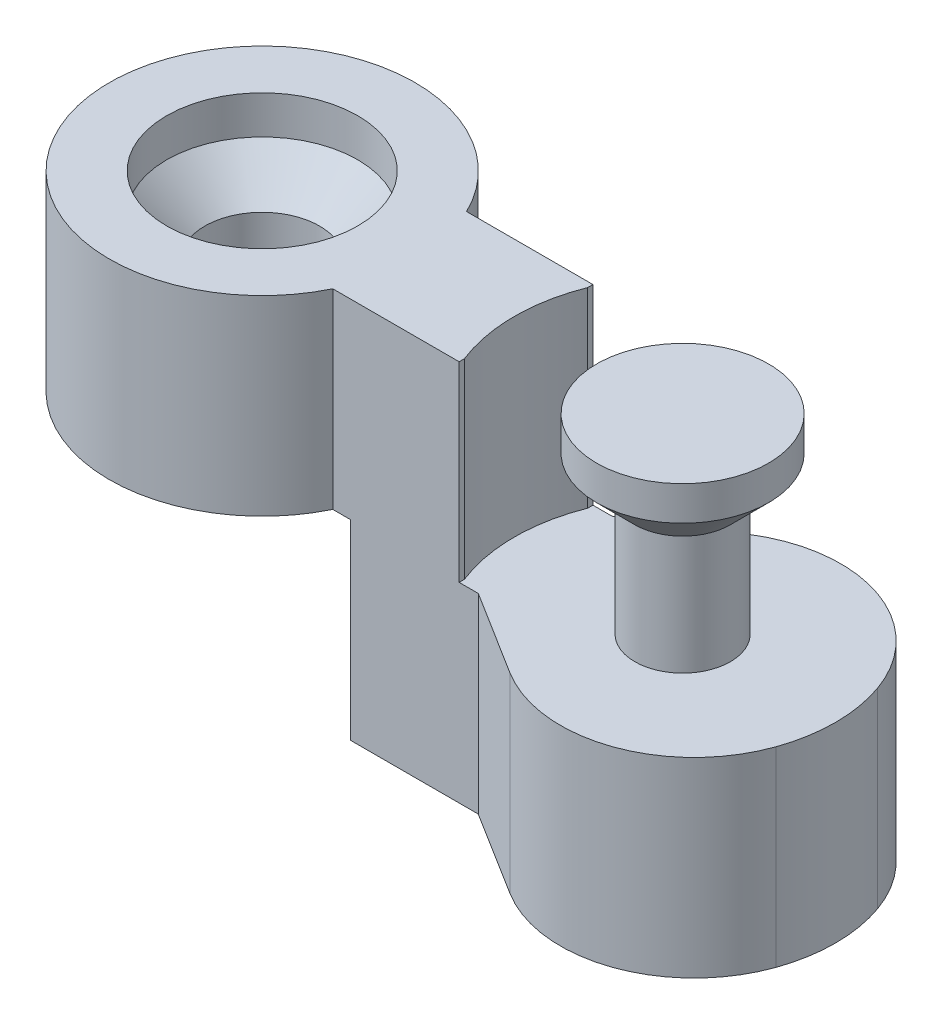
ISO-10303-21;
HEADER;
FILE_DESCRIPTION(('STEP AP214'),'2;1');
FILE_NAME('part.step','',(''),(''),'','','');
FILE_SCHEMA(('AUTOMOTIVE_DESIGN { 1 0 10303 214 1 1 1 1 }'));
ENDSEC;
DATA;
#1=APPLICATION_CONTEXT('core data for automotive mechanical design processes');
#2=APPLICATION_PROTOCOL_DEFINITION('international standard','automotive_design',2000,#1);
#3=PRODUCT_CONTEXT('',#1,'mechanical');
#4=PRODUCT('Part','Part','',(#3));
#5=PRODUCT_RELATED_PRODUCT_CATEGORY('part','',(#4));
#6=PRODUCT_DEFINITION_FORMATION('','',#4);
#7=PRODUCT_DEFINITION_CONTEXT('part definition',#1,'design');
#8=PRODUCT_DEFINITION('design','',#6,#7);
#9=PRODUCT_DEFINITION_SHAPE('','',#8);
#10=(LENGTH_UNIT() NAMED_UNIT(*) SI_UNIT(.MILLI.,.METRE.));
#11=(NAMED_UNIT(*) PLANE_ANGLE_UNIT() SI_UNIT($,.RADIAN.));
#12=(NAMED_UNIT(*) SI_UNIT($,.STERADIAN.) SOLID_ANGLE_UNIT());
#13=UNCERTAINTY_MEASURE_WITH_UNIT(LENGTH_MEASURE(1.E-05),#10,'distance_accuracy_value','');
#14=(GEOMETRIC_REPRESENTATION_CONTEXT(3) GLOBAL_UNCERTAINTY_ASSIGNED_CONTEXT((#13)) GLOBAL_UNIT_ASSIGNED_CONTEXT((#10,
#11,#12)) REPRESENTATION_CONTEXT('',''));
#15=CARTESIAN_POINT('',(0.,0.,0.));
#16=DIRECTION('',(0.,0.,1.));
#17=DIRECTION('',(1.,0.,0.));
#18=AXIS2_PLACEMENT_3D('',#15,#16,#17);
#19=CARTESIAN_POINT('',(13.8062527150309,10.5,-8.));
#20=DIRECTION('',(-1.,0.,0.));
#21=DIRECTION('',(0.,-1.,0.));
#22=AXIS2_PLACEMENT_3D('',#19,#20,#21);
#23=PLANE('',#22);
#24=DIRECTION('',(0.,0.,1.));
#25=VECTOR('',#24,1.);
#26=CARTESIAN_POINT('',(13.8062527150309,0.,-8.));
#27=LINE('',#26,#25);
#28=CARTESIAN_POINT('',(13.8062527150309,0.,3.2268548636484));
#29=VERTEX_POINT('',#28);
#30=CARTESIAN_POINT('',(13.8062527150309,0.,3.5));
#31=VERTEX_POINT('',#30);
#32=EDGE_CURVE('E221',#29,#31,#27,.T.);
#33=ORIENTED_EDGE('',*,*,#32,.F.);
#34=DIRECTION('',(0.,1.,0.));
#35=VECTOR('',#34,1.);
#36=CARTESIAN_POINT('',(13.8062527150309,0.,3.2268548636484));
#37=LINE('',#36,#35);
#38=CARTESIAN_POINT('',(13.8062527150309,10.0000000000001,3.22685486364839));
#39=VERTEX_POINT('',#38);
#40=EDGE_CURVE('E194',#29,#39,#37,.T.);
#41=ORIENTED_EDGE('',*,*,#40,.T.);
#42=DIRECTION('',(0.,0.,1.));
#43=VECTOR('',#42,1.);
#44=CARTESIAN_POINT('',(13.8062527150309,10.,0.));
#45=LINE('',#44,#43);
#46=CARTESIAN_POINT('',(13.8062527150309,10.,3.5));
#47=VERTEX_POINT('',#46);
#48=EDGE_CURVE('E234',#39,#47,#45,.T.);
#49=ORIENTED_EDGE('',*,*,#48,.T.);
#50=DIRECTION('',(0.,1.,0.));
#51=VECTOR('',#50,1.);
#52=CARTESIAN_POINT('',(13.8062527150309,10.,3.5));
#53=LINE('',#52,#51);
#54=EDGE_CURVE('E238',#31,#47,#53,.T.);
#55=ORIENTED_EDGE('',*,*,#54,.F.);
#56=EDGE_LOOP('',(#33,#41,#49,#55));
#57=FACE_BOUND('',#56,.T.);
#58=ADVANCED_FACE('F43',(#57),#23,.F.);
#59=CARTESIAN_POINT('',(0.,10.,0.));
#60=DIRECTION('',(0.,-1.,0.));
#61=DIRECTION('',(0.,0.,-1.));
#62=AXIS2_PLACEMENT_3D('',#59,#60,#61);
#63=CYLINDRICAL_SURFACE('',#62,8.);
#64=CARTESIAN_POINT('',(0.,0.,0.));
#65=DIRECTION('',(0.,1.,0.));
#66=DIRECTION('',(0.,0.,1.));
#67=AXIS2_PLACEMENT_3D('',#64,#65,#66);
#68=CIRCLE('',#67,8.);
#69=CARTESIAN_POINT('',(7.19374728496908,0.,-3.5));
#70=VERTEX_POINT('',#69);
#71=CARTESIAN_POINT('',(7.19374728496908,0.,3.5));
#72=VERTEX_POINT('',#71);
#73=EDGE_CURVE('E159',#70,#72,#68,.T.);
#74=ORIENTED_EDGE('',*,*,#73,.T.);
#75=DIRECTION('',(0.,-1.,0.));
#76=VECTOR('',#75,1.);
#77=CARTESIAN_POINT('',(7.19374728496908,10.,3.5));
#78=LINE('',#77,#76);
#79=CARTESIAN_POINT('',(7.19374728496908,10.,3.5));
#80=VERTEX_POINT('',#79);
#81=EDGE_CURVE('E263',#80,#72,#78,.T.);
#82=ORIENTED_EDGE('',*,*,#81,.F.);
#83=CARTESIAN_POINT('',(0.,10.,0.));
#84=DIRECTION('',(0.,1.,0.));
#85=DIRECTION('',(0.,0.,1.));
#86=AXIS2_PLACEMENT_3D('',#83,#84,#85);
#87=CIRCLE('',#86,8.);
#88=CARTESIAN_POINT('',(7.19374728496908,10.,-3.5));
#89=VERTEX_POINT('',#88);
#90=EDGE_CURVE('E266',#89,#80,#87,.T.);
#91=ORIENTED_EDGE('',*,*,#90,.F.);
#92=DIRECTION('',(0.,-1.,0.));
#93=VECTOR('',#92,1.);
#94=CARTESIAN_POINT('',(7.19374728496908,10.,-3.5));
#95=LINE('',#94,#93);
#96=EDGE_CURVE('E247',#89,#70,#95,.T.);
#97=ORIENTED_EDGE('',*,*,#96,.T.);
#98=EDGE_LOOP('',(#74,#82,#91,#97));
#99=FACE_BOUND('',#98,.T.);
#100=ADVANCED_FACE('F328',(#99),#63,.T.);
#101=CARTESIAN_POINT('',(0.,10.,0.));
#102=DIRECTION('',(0.,1.,0.));
#103=DIRECTION('',(0.,0.,1.));
#104=AXIS2_PLACEMENT_3D('',#101,#102,#103);
#105=PLANE('',#104);
#106=CARTESIAN_POINT('',(22.,10.0000000000001,0.));
#107=DIRECTION('',(0.,1.,0.));
#108=DIRECTION('',(0.,0.,1.));
#109=AXIS2_PLACEMENT_3D('',#106,#107,#108);
#110=CIRCLE('',#109,8.80625271503092);
#111=CARTESIAN_POINT('',(13.8062527150309,10.0000000000001,-3.22685486364839));
#112=VERTEX_POINT('',#111);
#113=EDGE_CURVE('E187',#112,#39,#110,.T.);
#114=ORIENTED_EDGE('',*,*,#113,.F.);
#115=CARTESIAN_POINT('',(13.8062527150309,10.,-3.5));
#116=VERTEX_POINT('',#115);
#117=EDGE_CURVE('E235',#116,#112,#45,.T.);
#118=ORIENTED_EDGE('',*,*,#117,.F.);
#119=DIRECTION('',(-1.,0.,0.));
#120=VECTOR('',#119,1.);
#121=CARTESIAN_POINT('',(7.19374728496908,10.,-3.5));
#122=LINE('',#121,#120);
#123=EDGE_CURVE('E245',#116,#89,#122,.T.);
#124=ORIENTED_EDGE('',*,*,#123,.T.);
#125=ORIENTED_EDGE('',*,*,#90,.T.);
#126=DIRECTION('',(1.,0.,0.));
#127=VECTOR('',#126,1.);
#128=CARTESIAN_POINT('',(7.19374728496908,10.,3.5));
#129=LINE('',#128,#127);
#130=EDGE_CURVE('E242',#80,#47,#129,.T.);
#131=ORIENTED_EDGE('',*,*,#130,.T.);
#132=ORIENTED_EDGE('',*,*,#48,.F.);
#133=EDGE_LOOP('',(#114,#118,#124,#125,#131,#132));
#134=FACE_BOUND('',#133,.T.);
#135=CARTESIAN_POINT('',(0.,10.0000000000001,0.));
#136=DIRECTION('',(0.,1.,0.));
#137=DIRECTION('',(0.,0.,1.));
#138=AXIS2_PLACEMENT_3D('',#135,#136,#137);
#139=CIRCLE('',#138,4.99999999999999);
#140=CARTESIAN_POINT('',(0.,10.0000000000001,4.99999999999999));
#141=VERTEX_POINT('',#140);
#142=EDGE_CURVE('E209',#141,#141,#139,.T.);
#143=ORIENTED_EDGE('',*,*,#142,.F.);
#144=EDGE_LOOP('',(#143));
#145=FACE_BOUND('',#144,.T.);
#146=ADVANCED_FACE('F336',(#134,#145),#105,.T.);
#147=CARTESIAN_POINT('',(0.,-10.,0.));
#148=DIRECTION('',(0.,1.,0.));
#149=DIRECTION('',(0.,0.,1.));
#150=AXIS2_PLACEMENT_3D('',#147,#148,#149);
#151=PLANE('',#150);
#152=DIRECTION('',(1.,0.,0.));
#153=VECTOR('',#152,1.);
#154=CARTESIAN_POINT('',(7.19374728496908,-10.,3.5));
#155=LINE('',#154,#153);
#156=CARTESIAN_POINT('',(8.12592127638456,-10.,3.5));
#157=VERTEX_POINT('',#156);
#158=CARTESIAN_POINT('',(14.8062527150309,-10.,3.5));
#159=VERTEX_POINT('',#158);
#160=EDGE_CURVE('E241',#157,#159,#155,.T.);
#161=ORIENTED_EDGE('',*,*,#160,.F.);
#162=CARTESIAN_POINT('',(-0.30625271503092,-10.,0.353821082885416));
#163=DIRECTION('',(0.,-1.,0.));
#164=DIRECTION('',(0.,0.,-1.));
#165=AXIS2_PLACEMENT_3D('',#162,#163,#164);
#166=CIRCLE('',#165,9.);
#167=CARTESIAN_POINT('',(8.69374728496908,-10.,0.353821082885416));
#168=VERTEX_POINT('',#167);
#169=EDGE_CURVE('E174',#168,#157,#166,.T.);
#170=ORIENTED_EDGE('',*,*,#169,.F.);
#171=DIRECTION('',(0.,0.,1.));
#172=VECTOR('',#171,1.);
#173=CARTESIAN_POINT('',(8.69374728496908,-10.,0.));
#174=LINE('',#173,#172);
#175=CARTESIAN_POINT('',(8.69374728496908,-10.,-3.5));
#176=VERTEX_POINT('',#175);
#177=EDGE_CURVE('E299',#176,#168,#174,.T.);
#178=ORIENTED_EDGE('',*,*,#177,.F.);
#179=DIRECTION('',(-1.,0.,0.));
#180=VECTOR('',#179,1.);
#181=CARTESIAN_POINT('',(7.19374728496908,-10.,-3.5));
#182=LINE('',#181,#180);
#183=CARTESIAN_POINT('',(14.8062527150309,-10.,-3.5));
#184=VERTEX_POINT('',#183);
#185=EDGE_CURVE('E180',#184,#176,#182,.T.);
#186=ORIENTED_EDGE('',*,*,#185,.F.);
#187=DIRECTION('',(-0.847791247890659,0.,0.530330085889911));
#188=VECTOR('',#187,1.);
#189=CARTESIAN_POINT('',(14.8062527150309,-10.,-3.5));
#190=LINE('',#189,#188);
#191=CARTESIAN_POINT('',(19.2305896226808,-10.,-6.26761405366909));
#192=VERTEX_POINT('',#191);
#193=EDGE_CURVE('E254',#192,#184,#190,.T.);
#194=ORIENTED_EDGE('',*,*,#193,.F.);
#195=CARTESIAN_POINT('',(22.9429002239101,-10.,-0.333075318434476));
#196=DIRECTION('',(0.,1.,0.));
#197=DIRECTION('',(0.,0.,1.));
#198=AXIS2_PLACEMENT_3D('',#195,#196,#197);
#199=CIRCLE('',#198,7.);
#200=CARTESIAN_POINT('',(29.543201791281,-10.,-2.66460254747581));
#201=VERTEX_POINT('',#200);
#202=EDGE_CURVE('E280',#192,#201,#199,.F.);
#203=ORIENTED_EDGE('',*,*,#202,.T.);
#204=CARTESIAN_POINT('',(22.,-10.,0.));
#205=DIRECTION('',(0.,1.,0.));
#206=DIRECTION('',(0.,0.,1.));
#207=AXIS2_PLACEMENT_3D('',#204,#205,#206);
#208=CIRCLE('',#207,8.);
#209=CARTESIAN_POINT('',(29.543201791281,-10.,2.66460254747582));
#210=VERTEX_POINT('',#209);
#211=EDGE_CURVE('E251',#210,#201,#208,.T.);
#212=ORIENTED_EDGE('',*,*,#211,.F.);
#213=CARTESIAN_POINT('',(22.9429002239101,-10.,0.333075318434476));
#214=DIRECTION('',(0.,1.,0.));
#215=DIRECTION('',(0.,0.,1.));
#216=AXIS2_PLACEMENT_3D('',#213,#214,#215);
#217=CIRCLE('',#216,7.);
#218=CARTESIAN_POINT('',(19.2305896226807,-10.,6.26761405366908));
#219=VERTEX_POINT('',#218);
#220=EDGE_CURVE('E282',#210,#219,#217,.F.);
#221=ORIENTED_EDGE('',*,*,#220,.T.);
#222=DIRECTION('',(0.847791247890659,0.,0.530330085889911));
#223=VECTOR('',#222,1.);
#224=CARTESIAN_POINT('',(14.8062527150309,-10.,3.5));
#225=LINE('',#224,#223);
#226=EDGE_CURVE('E249',#159,#219,#225,.T.);
#227=ORIENTED_EDGE('',*,*,#226,.F.);
#228=EDGE_LOOP('',(#161,#170,#178,#186,#194,#203,#212,#221,#227));
#229=FACE_BOUND('',#228,.T.);
#230=ADVANCED_FACE('F296',(#229),#151,.F.);
#231=CARTESIAN_POINT('',(7.19374728496908,10.,3.5));
#232=DIRECTION('',(0.,0.,-1.));
#233=DIRECTION('',(-1.,0.,0.));
#234=AXIS2_PLACEMENT_3D('',#231,#232,#233);
#235=PLANE('',#234);
#236=DIRECTION('',(-1.,0.,0.));
#237=VECTOR('',#236,1.);
#238=CARTESIAN_POINT('',(7.19374728496908,0.,3.5));
#239=LINE('',#238,#237);
#240=CARTESIAN_POINT('',(8.12592127638456,0.,3.5));
#241=VERTEX_POINT('',#240);
#242=EDGE_CURVE('E164',#241,#72,#239,.T.);
#243=ORIENTED_EDGE('',*,*,#242,.F.);
#244=DIRECTION('',(0.,-1.,0.));
#245=VECTOR('',#244,1.);
#246=CARTESIAN_POINT('',(8.12592127638456,0.,3.5));
#247=LINE('',#246,#245);
#248=EDGE_CURVE('E11',#241,#157,#247,.T.);
#249=ORIENTED_EDGE('',*,*,#248,.T.);
#250=ORIENTED_EDGE('',*,*,#160,.T.);
#251=DIRECTION('',(0.,-1.,0.));
#252=VECTOR('',#251,1.);
#253=CARTESIAN_POINT('',(14.8062527150309,10.,3.5));
#254=LINE('',#253,#252);
#255=CARTESIAN_POINT('',(14.8062527150309,0.,3.5));
#256=VERTEX_POINT('',#255);
#257=EDGE_CURVE('E260',#256,#159,#254,.T.);
#258=ORIENTED_EDGE('',*,*,#257,.F.);
#259=DIRECTION('',(-1.,0.,0.));
#260=VECTOR('',#259,1.);
#261=CARTESIAN_POINT('',(7.19374728496908,0.,3.5));
#262=LINE('',#261,#260);
#263=EDGE_CURVE('E232',#256,#31,#262,.T.);
#264=ORIENTED_EDGE('',*,*,#263,.T.);
#265=ORIENTED_EDGE('',*,*,#54,.T.);
#266=ORIENTED_EDGE('',*,*,#130,.F.);
#267=ORIENTED_EDGE('',*,*,#81,.T.);
#268=EDGE_LOOP('',(#243,#249,#250,#258,#264,#265,#266,#267));
#269=FACE_BOUND('',#268,.T.);
#270=ADVANCED_FACE('F305',(#269),#235,.F.);
#271=CARTESIAN_POINT('',(14.8062527150309,10.,3.5));
#272=DIRECTION('',(0.530330085889911,0.,-0.847791247890659));
#273=DIRECTION('',(-0.847791247890659,0.,-0.530330085889911));
#274=AXIS2_PLACEMENT_3D('',#271,#272,#273);
#275=PLANE('',#274);
#276=ORIENTED_EDGE('',*,*,#226,.T.);
#277=DIRECTION('',(0.,-1.,0.));
#278=VECTOR('',#277,1.);
#279=CARTESIAN_POINT('',(19.2305896226807,10.,6.26761405366908));
#280=LINE('',#279,#278);
#281=CARTESIAN_POINT('',(19.2305896226807,0.,6.26761405366908));
#282=VERTEX_POINT('',#281);
#283=EDGE_CURVE('E66',#219,#282,#280,.F.);
#284=ORIENTED_EDGE('',*,*,#283,.T.);
#285=DIRECTION('',(-0.847791247890659,0.,-0.530330085889911));
#286=VECTOR('',#285,1.);
#287=CARTESIAN_POINT('',(14.8062527150309,0.,3.5));
#288=LINE('',#287,#286);
#289=EDGE_CURVE('E230',#282,#256,#288,.T.);
#290=ORIENTED_EDGE('',*,*,#289,.T.);
#291=ORIENTED_EDGE('',*,*,#257,.T.);
#292=EDGE_LOOP('',(#276,#284,#290,#291));
#293=FACE_BOUND('',#292,.T.);
#294=ADVANCED_FACE('F308',(#293),#275,.F.);
#295=CARTESIAN_POINT('',(22.,10.,0.));
#296=DIRECTION('',(0.,-1.,0.));
#297=DIRECTION('',(0.,0.,-1.));
#298=AXIS2_PLACEMENT_3D('',#295,#296,#297);
#299=CYLINDRICAL_SURFACE('',#298,8.);
#300=CARTESIAN_POINT('',(22.,0.,0.));
#301=DIRECTION('',(0.,-1.,0.));
#302=DIRECTION('',(0.,0.,-1.));
#303=AXIS2_PLACEMENT_3D('',#300,#301,#302);
#304=CIRCLE('',#303,8.);
#305=CARTESIAN_POINT('',(29.543201791281,0.,-2.66460254747581));
#306=VERTEX_POINT('',#305);
#307=CARTESIAN_POINT('',(29.543201791281,0.,2.66460254747582));
#308=VERTEX_POINT('',#307);
#309=EDGE_CURVE('E227',#306,#308,#304,.T.);
#310=ORIENTED_EDGE('',*,*,#309,.T.);
#311=DIRECTION('',(0.,-1.,0.));
#312=VECTOR('',#311,1.);
#313=CARTESIAN_POINT('',(29.543201791281,10.,2.66460254747582));
#314=LINE('',#313,#312);
#315=EDGE_CURVE('E277',#308,#210,#314,.T.);
#316=ORIENTED_EDGE('',*,*,#315,.T.);
#317=ORIENTED_EDGE('',*,*,#211,.T.);
#318=DIRECTION('',(0.,-1.,0.));
#319=VECTOR('',#318,1.);
#320=CARTESIAN_POINT('',(29.543201791281,10.,-2.66460254747581));
#321=LINE('',#320,#319);
#322=EDGE_CURVE('E275',#201,#306,#321,.F.);
#323=ORIENTED_EDGE('',*,*,#322,.T.);
#324=EDGE_LOOP('',(#310,#316,#317,#323));
#325=FACE_BOUND('',#324,.T.);
#326=ADVANCED_FACE('F317',(#325),#299,.T.);
#327=CARTESIAN_POINT('',(14.8062527150309,10.,-3.5));
#328=DIRECTION('',(0.530330085889911,0.,0.847791247890659));
#329=DIRECTION('',(0.847791247890659,0.,-0.530330085889911));
#330=AXIS2_PLACEMENT_3D('',#327,#328,#329);
#331=PLANE('',#330);
#332=DIRECTION('',(0.847791247890659,0.,-0.530330085889911));
#333=VECTOR('',#332,1.);
#334=CARTESIAN_POINT('',(14.8062527150309,0.,-3.5));
#335=LINE('',#334,#333);
#336=CARTESIAN_POINT('',(14.8062527150309,0.,-3.5));
#337=VERTEX_POINT('',#336);
#338=CARTESIAN_POINT('',(19.2305896226808,0.,-6.26761405366909));
#339=VERTEX_POINT('',#338);
#340=EDGE_CURVE('E225',#337,#339,#335,.T.);
#341=ORIENTED_EDGE('',*,*,#340,.T.);
#342=DIRECTION('',(0.,-1.,0.));
#343=VECTOR('',#342,1.);
#344=CARTESIAN_POINT('',(19.2305896226808,10.,-6.26761405366909));
#345=LINE('',#344,#343);
#346=EDGE_CURVE('E51',#339,#192,#345,.T.);
#347=ORIENTED_EDGE('',*,*,#346,.T.);
#348=ORIENTED_EDGE('',*,*,#193,.T.);
#349=DIRECTION('',(0.,-1.,0.));
#350=VECTOR('',#349,1.);
#351=CARTESIAN_POINT('',(14.8062527150309,10.,-3.5));
#352=LINE('',#351,#350);
#353=EDGE_CURVE('E258',#337,#184,#352,.T.);
#354=ORIENTED_EDGE('',*,*,#353,.F.);
#355=EDGE_LOOP('',(#341,#347,#348,#354));
#356=FACE_BOUND('',#355,.T.);
#357=ADVANCED_FACE('F291',(#356),#331,.F.);
#358=CARTESIAN_POINT('',(7.19374728496908,10.,-3.5));
#359=DIRECTION('',(0.,0.,1.));
#360=DIRECTION('',(1.,0.,0.));
#361=AXIS2_PLACEMENT_3D('',#358,#359,#360);
#362=PLANE('',#361);
#363=ORIENTED_EDGE('',*,*,#185,.T.);
#364=DIRECTION('',(0.,-1.,0.));
#365=VECTOR('',#364,1.);
#366=CARTESIAN_POINT('',(8.69374728496908,0.,-3.5));
#367=LINE('',#366,#365);
#368=CARTESIAN_POINT('',(8.69374728496908,0.,-3.5));
#369=VERTEX_POINT('',#368);
#370=EDGE_CURVE('E170',#369,#176,#367,.T.);
#371=ORIENTED_EDGE('',*,*,#370,.F.);
#372=DIRECTION('',(1.,0.,0.));
#373=VECTOR('',#372,1.);
#374=CARTESIAN_POINT('',(7.19374728496908,0.,-3.5));
#375=LINE('',#374,#373);
#376=EDGE_CURVE('E153',#70,#369,#375,.T.);
#377=ORIENTED_EDGE('',*,*,#376,.F.);
#378=ORIENTED_EDGE('',*,*,#96,.F.);
#379=ORIENTED_EDGE('',*,*,#123,.F.);
#380=DIRECTION('',(0.,-1.,0.));
#381=VECTOR('',#380,1.);
#382=CARTESIAN_POINT('',(13.8062527150309,10.,-3.5));
#383=LINE('',#382,#381);
#384=CARTESIAN_POINT('',(13.8062527150309,0.,-3.5));
#385=VERTEX_POINT('',#384);
#386=EDGE_CURVE('E271',#116,#385,#383,.T.);
#387=ORIENTED_EDGE('',*,*,#386,.T.);
#388=DIRECTION('',(1.,0.,0.));
#389=VECTOR('',#388,1.);
#390=CARTESIAN_POINT('',(7.19374728496908,0.,-3.5));
#391=LINE('',#390,#389);
#392=EDGE_CURVE('E269',#385,#337,#391,.T.);
#393=ORIENTED_EDGE('',*,*,#392,.T.);
#394=ORIENTED_EDGE('',*,*,#353,.T.);
#395=EDGE_LOOP('',(#363,#371,#377,#378,#379,#387,#393,#394));
#396=FACE_BOUND('',#395,.T.);
#397=ADVANCED_FACE('F177',(#396),#362,.F.);
#398=ORIENTED_EDGE('',*,*,#117,.T.);
#399=DIRECTION('',(0.,1.,0.));
#400=VECTOR('',#399,1.);
#401=CARTESIAN_POINT('',(13.8062527150309,0.,-3.2268548636484));
#402=LINE('',#401,#400);
#403=CARTESIAN_POINT('',(13.8062527150309,0.,-3.2268548636484));
#404=VERTEX_POINT('',#403);
#405=EDGE_CURVE('E190',#112,#404,#402,.F.);
#406=ORIENTED_EDGE('',*,*,#405,.T.);
#407=EDGE_CURVE('E222',#385,#404,#27,.T.);
#408=ORIENTED_EDGE('',*,*,#407,.F.);
#409=ORIENTED_EDGE('',*,*,#386,.F.);
#410=EDGE_LOOP('',(#398,#406,#408,#409));
#411=FACE_BOUND('',#410,.T.);
#412=ADVANCED_FACE('F331',(#411),#23,.F.);
#413=CARTESIAN_POINT('',(13.8062527150309,0.,-8.));
#414=DIRECTION('',(0.,-1.,0.));
#415=DIRECTION('',(0.,0.,-1.));
#416=AXIS2_PLACEMENT_3D('',#413,#414,#415);
#417=PLANE('',#416);
#418=ORIENTED_EDGE('',*,*,#289,.F.);
#419=CARTESIAN_POINT('',(22.9429002239101,0.,0.333075318434476));
#420=DIRECTION('',(0.,-1.,0.));
#421=DIRECTION('',(0.,0.,-1.));
#422=AXIS2_PLACEMENT_3D('',#419,#420,#421);
#423=CIRCLE('',#422,7.);
#424=EDGE_CURVE('E286',#282,#308,#423,.F.);
#425=ORIENTED_EDGE('',*,*,#424,.T.);
#426=ORIENTED_EDGE('',*,*,#309,.F.);
#427=CARTESIAN_POINT('',(22.9429002239101,0.,-0.333075318434476));
#428=DIRECTION('',(0.,-1.,0.));
#429=DIRECTION('',(0.,0.,-1.));
#430=AXIS2_PLACEMENT_3D('',#427,#428,#429);
#431=CIRCLE('',#430,7.);
#432=EDGE_CURVE('E58',#306,#339,#431,.F.);
#433=ORIENTED_EDGE('',*,*,#432,.T.);
#434=ORIENTED_EDGE('',*,*,#340,.F.);
#435=ORIENTED_EDGE('',*,*,#392,.F.);
#436=ORIENTED_EDGE('',*,*,#407,.T.);
#437=CARTESIAN_POINT('',(22.,0.,0.));
#438=DIRECTION('',(0.,1.,0.));
#439=DIRECTION('',(0.,0.,1.));
#440=AXIS2_PLACEMENT_3D('',#437,#438,#439);
#441=CIRCLE('',#440,8.80625271503092);
#442=EDGE_CURVE('E188',#404,#29,#441,.T.);
#443=ORIENTED_EDGE('',*,*,#442,.T.);
#444=ORIENTED_EDGE('',*,*,#32,.T.);
#445=ORIENTED_EDGE('',*,*,#263,.F.);
#446=EDGE_LOOP('',(#418,#425,#426,#433,#434,#435,#436,#443,#444,#445));
#447=FACE_BOUND('',#446,.T.);
#448=CARTESIAN_POINT('',(22.,0.,0.));
#449=DIRECTION('',(0.,1.,0.));
#450=DIRECTION('',(0.,0.,1.));
#451=AXIS2_PLACEMENT_3D('',#448,#449,#450);
#452=CIRCLE('',#451,2.50000000000005);
#453=CARTESIAN_POINT('',(22.,0.,2.50000000000005));
#454=VERTEX_POINT('',#453);
#455=EDGE_CURVE('E206',#454,#454,#452,.T.);
#456=ORIENTED_EDGE('',*,*,#455,.F.);
#457=EDGE_LOOP('',(#456));
#458=FACE_BOUND('',#457,.T.);
#459=ADVANCED_FACE('F313',(#447,#458),#417,.F.);
#460=CARTESIAN_POINT('',(-8.5,0.,-8.));
#461=DIRECTION('',(0.,1.,0.));
#462=DIRECTION('',(0.,0.,1.));
#463=AXIS2_PLACEMENT_3D('',#460,#461,#462);
#464=PLANE('',#463);
#465=CARTESIAN_POINT('',(0.,0.,0.));
#466=DIRECTION('',(0.,1.,0.));
#467=DIRECTION('',(0.,0.,1.));
#468=AXIS2_PLACEMENT_3D('',#465,#466,#467);
#469=CIRCLE('',#468,2.99999999999999);
#470=CARTESIAN_POINT('',(0.,0.,2.99999999999999));
#471=VERTEX_POINT('',#470);
#472=EDGE_CURVE('E218',#471,#471,#469,.T.);
#473=ORIENTED_EDGE('',*,*,#472,.T.);
#474=EDGE_LOOP('',(#473));
#475=FACE_BOUND('',#474,.T.);
#476=ORIENTED_EDGE('',*,*,#73,.F.);
#477=ORIENTED_EDGE('',*,*,#376,.T.);
#478=DIRECTION('',(0.,0.,1.));
#479=VECTOR('',#478,1.);
#480=CARTESIAN_POINT('',(8.69374728496908,0.,0.));
#481=LINE('',#480,#479);
#482=CARTESIAN_POINT('',(8.69374728496908,0.,0.353821082885416));
#483=VERTEX_POINT('',#482);
#484=EDGE_CURVE('E157',#369,#483,#481,.T.);
#485=ORIENTED_EDGE('',*,*,#484,.T.);
#486=CARTESIAN_POINT('',(-0.30625271503092,0.,0.353821082885416));
#487=DIRECTION('',(0.,-1.,0.));
#488=DIRECTION('',(0.,0.,-1.));
#489=AXIS2_PLACEMENT_3D('',#486,#487,#488);
#490=CIRCLE('',#489,9.);
#491=EDGE_CURVE('E173',#483,#241,#490,.T.);
#492=ORIENTED_EDGE('',*,*,#491,.T.);
#493=ORIENTED_EDGE('',*,*,#242,.T.);
#494=EDGE_LOOP('',(#476,#477,#485,#492,#493));
#495=FACE_BOUND('',#494,.T.);
#496=ADVANCED_FACE('F155',(#475,#495),#464,.F.);
#497=CARTESIAN_POINT('',(0.,11.592954006499,0.));
#498=DIRECTION('',(0.,1.,0.));
#499=DIRECTION('',(0.,0.,1.));
#500=AXIS2_PLACEMENT_3D('',#497,#498,#499);
#501=CYLINDRICAL_SURFACE('',#500,2.99999999999999);
#502=CARTESIAN_POINT('',(0.,6.00000000000006,0.));
#503=DIRECTION('',(0.,1.,0.));
#504=DIRECTION('',(0.,0.,1.));
#505=AXIS2_PLACEMENT_3D('',#502,#503,#504);
#506=CIRCLE('',#505,2.99999999999999);
#507=CARTESIAN_POINT('',(0.,6.00000000000006,2.99999999999999));
#508=VERTEX_POINT('',#507);
#509=EDGE_CURVE('E215',#508,#508,#506,.T.);
#510=ORIENTED_EDGE('',*,*,#509,.T.);
#511=EDGE_LOOP('',(#510));
#512=FACE_BOUND('',#511,.T.);
#513=ORIENTED_EDGE('',*,*,#472,.F.);
#514=EDGE_LOOP('',(#513));
#515=FACE_BOUND('',#514,.T.);
#516=ADVANCED_FACE('F391',(#512,#515),#501,.F.);
#517=CARTESIAN_POINT('',(0.,6.00000000000006,0.));
#518=DIRECTION('',(0.,1.,0.));
#519=DIRECTION('',(0.,0.,1.));
#520=AXIS2_PLACEMENT_3D('',#517,#518,#519);
#521=CONICAL_SURFACE('',#520,2.99999999999999,0.785398163397448);
#522=CARTESIAN_POINT('',(0.,8.00000000000006,0.));
#523=DIRECTION('',(0.,1.,0.));
#524=DIRECTION('',(0.,0.,1.));
#525=AXIS2_PLACEMENT_3D('',#522,#523,#524);
#526=CIRCLE('',#525,4.99999999999999);
#527=CARTESIAN_POINT('',(0.,8.00000000000006,4.99999999999999));
#528=VERTEX_POINT('',#527);
#529=EDGE_CURVE('E212',#528,#528,#526,.T.);
#530=ORIENTED_EDGE('',*,*,#529,.T.);
#531=EDGE_LOOP('',(#530));
#532=FACE_BOUND('',#531,.T.);
#533=ORIENTED_EDGE('',*,*,#509,.F.);
#534=EDGE_LOOP('',(#533));
#535=FACE_BOUND('',#534,.T.);
#536=ADVANCED_FACE('F387',(#532,#535),#521,.F.);
#537=CARTESIAN_POINT('',(0.,11.592954006499,0.));
#538=DIRECTION('',(0.,1.,0.));
#539=DIRECTION('',(0.,0.,1.));
#540=AXIS2_PLACEMENT_3D('',#537,#538,#539);
#541=CYLINDRICAL_SURFACE('',#540,4.99999999999999);
#542=ORIENTED_EDGE('',*,*,#142,.T.);
#543=EDGE_LOOP('',(#542));
#544=FACE_BOUND('',#543,.T.);
#545=ORIENTED_EDGE('',*,*,#529,.F.);
#546=EDGE_LOOP('',(#545));
#547=FACE_BOUND('',#546,.T.);
#548=ADVANCED_FACE('F383',(#544,#547),#541,.F.);
#549=CARTESIAN_POINT('',(22.,10.0000000000001,0.));
#550=DIRECTION('',(0.,1.,0.));
#551=DIRECTION('',(0.,0.,1.));
#552=AXIS2_PLACEMENT_3D('',#549,#550,#551);
#553=CYLINDRICAL_SURFACE('',#552,2.50000000000005);
#554=ORIENTED_EDGE('',*,*,#455,.T.);
#555=EDGE_LOOP('',(#554));
#556=FACE_BOUND('',#555,.T.);
#557=CARTESIAN_POINT('',(22.,6.20710678118668,0.));
#558=DIRECTION('',(0.,1.,0.));
#559=DIRECTION('',(0.,0.,1.));
#560=AXIS2_PLACEMENT_3D('',#557,#558,#559);
#561=CIRCLE('',#560,2.50000000000005);
#562=CARTESIAN_POINT('',(22.,6.20710678118668,2.50000000000005));
#563=VERTEX_POINT('',#562);
#564=EDGE_CURVE('E203',#563,#563,#561,.T.);
#565=ORIENTED_EDGE('',*,*,#564,.F.);
#566=EDGE_LOOP('',(#565));
#567=FACE_BOUND('',#566,.T.);
#568=ADVANCED_FACE('F379',(#556,#567),#553,.T.);
#569=CARTESIAN_POINT('',(22.,8.20710678118668,0.));
#570=DIRECTION('',(0.,1.,0.));
#571=DIRECTION('',(0.,0.,1.));
#572=AXIS2_PLACEMENT_3D('',#569,#570,#571);
#573=CONICAL_SURFACE('',#572,4.50000000000006,0.785398163397449);
#574=ORIENTED_EDGE('',*,*,#564,.T.);
#575=EDGE_LOOP('',(#574));
#576=FACE_BOUND('',#575,.T.);
#577=CARTESIAN_POINT('',(22.,8.20710678118668,0.));
#578=DIRECTION('',(0.,1.,0.));
#579=DIRECTION('',(0.,0.,1.));
#580=AXIS2_PLACEMENT_3D('',#577,#578,#579);
#581=CIRCLE('',#580,4.50000000000006);
#582=CARTESIAN_POINT('',(22.,8.20710678118668,4.50000000000006));
#583=VERTEX_POINT('',#582);
#584=EDGE_CURVE('E200',#583,#583,#581,.T.);
#585=ORIENTED_EDGE('',*,*,#584,.F.);
#586=EDGE_LOOP('',(#585));
#587=FACE_BOUND('',#586,.T.);
#588=ADVANCED_FACE('F375',(#576,#587),#573,.T.);
#589=CARTESIAN_POINT('',(22.,10.0000000000001,0.));
#590=DIRECTION('',(0.,1.,0.));
#591=DIRECTION('',(0.,0.,1.));
#592=AXIS2_PLACEMENT_3D('',#589,#590,#591);
#593=CYLINDRICAL_SURFACE('',#592,4.50000000000006);
#594=ORIENTED_EDGE('',*,*,#584,.T.);
#595=EDGE_LOOP('',(#594));
#596=FACE_BOUND('',#595,.T.);
#597=CARTESIAN_POINT('',(22.,10.0000000000001,0.));
#598=DIRECTION('',(0.,1.,0.));
#599=DIRECTION('',(0.,0.,1.));
#600=AXIS2_PLACEMENT_3D('',#597,#598,#599);
#601=CIRCLE('',#600,4.50000000000006);
#602=CARTESIAN_POINT('',(22.,10.0000000000001,4.50000000000006));
#603=VERTEX_POINT('',#602);
#604=EDGE_CURVE('E197',#603,#603,#601,.T.);
#605=ORIENTED_EDGE('',*,*,#604,.F.);
#606=EDGE_LOOP('',(#605));
#607=FACE_BOUND('',#606,.T.);
#608=ADVANCED_FACE('F368',(#596,#607),#593,.T.);
#609=CARTESIAN_POINT('',(0.,10.0000000000001,0.));
#610=DIRECTION('',(0.,1.,0.));
#611=DIRECTION('',(0.,0.,1.));
#612=AXIS2_PLACEMENT_3D('',#609,#610,#611);
#613=PLANE('',#612);
#614=ORIENTED_EDGE('',*,*,#604,.T.);
#615=EDGE_LOOP('',(#614));
#616=FACE_BOUND('',#615,.T.);
#617=ADVANCED_FACE('F363',(#616),#613,.T.);
#618=CARTESIAN_POINT('',(22.,0.,0.));
#619=DIRECTION('',(0.,1.,0.));
#620=DIRECTION('',(0.,0.,1.));
#621=AXIS2_PLACEMENT_3D('',#618,#619,#620);
#622=CYLINDRICAL_SURFACE('',#621,8.80625271503092);
#623=ORIENTED_EDGE('',*,*,#442,.F.);
#624=ORIENTED_EDGE('',*,*,#405,.F.);
#625=ORIENTED_EDGE('',*,*,#113,.T.);
#626=ORIENTED_EDGE('',*,*,#40,.F.);
#627=EDGE_LOOP('',(#623,#624,#625,#626));
#628=FACE_BOUND('',#627,.T.);
#629=ADVANCED_FACE('F326',(#628),#622,.F.);
#630=CARTESIAN_POINT('',(22.9429002239101,10.,0.333075318434476));
#631=DIRECTION('',(0.,-1.,0.));
#632=DIRECTION('',(0.,0.,-1.));
#633=AXIS2_PLACEMENT_3D('',#630,#631,#632);
#634=CYLINDRICAL_SURFACE('',#633,7.);
#635=ORIENTED_EDGE('',*,*,#424,.F.);
#636=ORIENTED_EDGE('',*,*,#283,.F.);
#637=ORIENTED_EDGE('',*,*,#220,.F.);
#638=ORIENTED_EDGE('',*,*,#315,.F.);
#639=EDGE_LOOP('',(#635,#636,#637,#638));
#640=FACE_BOUND('',#639,.T.);
#641=ADVANCED_FACE('F311',(#640),#634,.T.);
#642=CARTESIAN_POINT('',(22.9429002239101,10.,-0.333075318434476));
#643=DIRECTION('',(0.,-1.,0.));
#644=DIRECTION('',(0.,0.,-1.));
#645=AXIS2_PLACEMENT_3D('',#642,#643,#644);
#646=CYLINDRICAL_SURFACE('',#645,7.);
#647=ORIENTED_EDGE('',*,*,#432,.F.);
#648=ORIENTED_EDGE('',*,*,#322,.F.);
#649=ORIENTED_EDGE('',*,*,#202,.F.);
#650=ORIENTED_EDGE('',*,*,#346,.F.);
#651=EDGE_LOOP('',(#647,#648,#649,#650));
#652=FACE_BOUND('',#651,.T.);
#653=ADVANCED_FACE('F45',(#652),#646,.T.);
#654=CARTESIAN_POINT('',(-0.30625271503092,0.,0.353821082885416));
#655=DIRECTION('',(0.,-1.,0.));
#656=DIRECTION('',(0.,0.,-1.));
#657=AXIS2_PLACEMENT_3D('',#654,#655,#656);
#658=CYLINDRICAL_SURFACE('',#657,9.);
#659=ORIENTED_EDGE('',*,*,#491,.F.);
#660=DIRECTION('',(0.,-1.,0.));
#661=VECTOR('',#660,1.);
#662=CARTESIAN_POINT('',(8.69374728496908,0.,0.353821082885416));
#663=LINE('',#662,#661);
#664=EDGE_CURVE('E165',#483,#168,#663,.T.);
#665=ORIENTED_EDGE('',*,*,#664,.T.);
#666=ORIENTED_EDGE('',*,*,#169,.T.);
#667=ORIENTED_EDGE('',*,*,#248,.F.);
#668=EDGE_LOOP('',(#659,#665,#666,#667));
#669=FACE_BOUND('',#668,.T.);
#670=ADVANCED_FACE('F302',(#669),#658,.F.);
#671=CARTESIAN_POINT('',(8.69374728496908,0.,0.));
#672=DIRECTION('',(1.,0.,0.));
#673=DIRECTION('',(0.,0.,-1.));
#674=AXIS2_PLACEMENT_3D('',#671,#672,#673);
#675=PLANE('',#674);
#676=ORIENTED_EDGE('',*,*,#177,.T.);
#677=ORIENTED_EDGE('',*,*,#664,.F.);
#678=ORIENTED_EDGE('',*,*,#484,.F.);
#679=ORIENTED_EDGE('',*,*,#370,.T.);
#680=EDGE_LOOP('',(#676,#677,#678,#679));
#681=FACE_BOUND('',#680,.T.);
#682=ADVANCED_FACE('F169',(#681),#675,.F.);
#683=CLOSED_SHELL('',(#58,#100,#146,#230,#270,#294,#326,#357,#397,#412,#459,#496,#516,#536,#548,
#568,#588,#608,#617,#629,#641,#653,#670,#682));
#684=MANIFOLD_SOLID_BREP('B2',#683);
#685=ADVANCED_BREP_SHAPE_REPRESENTATION('',(#18,#684),#14);
#686=SHAPE_DEFINITION_REPRESENTATION(#9,#685);
ENDSEC;
END-ISO-10303-21;
